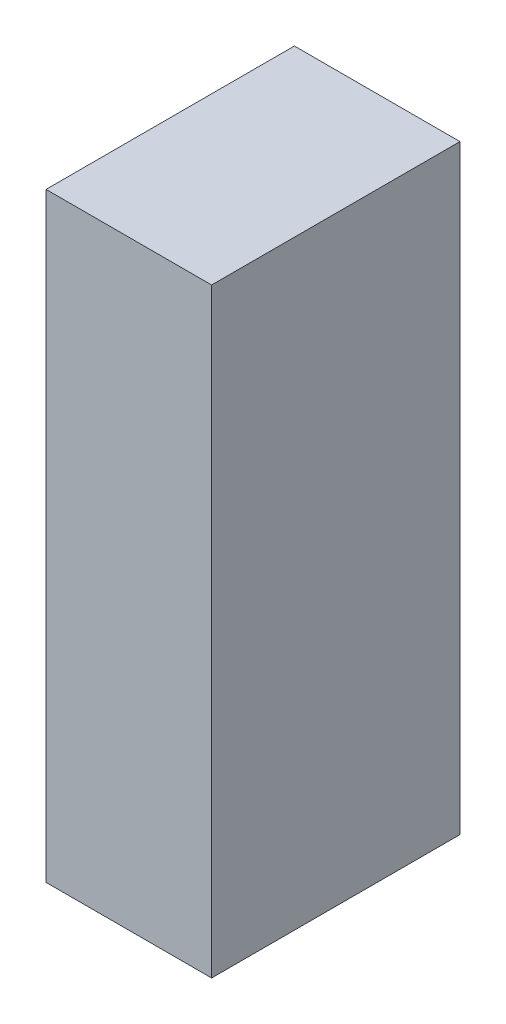
ISO-10303-21;
HEADER;
FILE_DESCRIPTION(('STEP AP214'),'2;1');
FILE_NAME('part.step','',(''),(''),'','','');
FILE_SCHEMA(('AUTOMOTIVE_DESIGN { 1 0 10303 214 1 1 1 1 }'));
ENDSEC;
DATA;
#1=APPLICATION_CONTEXT('core data for automotive mechanical design processes');
#2=APPLICATION_PROTOCOL_DEFINITION('international standard','automotive_design',2000,#1);
#3=PRODUCT_CONTEXT('',#1,'mechanical');
#4=PRODUCT('Part','Part','',(#3));
#5=PRODUCT_RELATED_PRODUCT_CATEGORY('part','',(#4));
#6=PRODUCT_DEFINITION_FORMATION('','',#4);
#7=PRODUCT_DEFINITION_CONTEXT('part definition',#1,'design');
#8=PRODUCT_DEFINITION('design','',#6,#7);
#9=PRODUCT_DEFINITION_SHAPE('','',#8);
#10=(LENGTH_UNIT() NAMED_UNIT(*) SI_UNIT(.MILLI.,.METRE.));
#11=(NAMED_UNIT(*) PLANE_ANGLE_UNIT() SI_UNIT($,.RADIAN.));
#12=(NAMED_UNIT(*) SI_UNIT($,.STERADIAN.) SOLID_ANGLE_UNIT());
#13=UNCERTAINTY_MEASURE_WITH_UNIT(LENGTH_MEASURE(1.E-05),#10,'distance_accuracy_value','');
#14=(GEOMETRIC_REPRESENTATION_CONTEXT(3) GLOBAL_UNCERTAINTY_ASSIGNED_CONTEXT((#13)) GLOBAL_UNIT_ASSIGNED_CONTEXT((#10,
#11,#12)) REPRESENTATION_CONTEXT('',''));
#15=CARTESIAN_POINT('',(0.,0.,0.));
#16=DIRECTION('',(0.,0.,1.));
#17=DIRECTION('',(1.,0.,0.));
#18=AXIS2_PLACEMENT_3D('',#15,#16,#17);
#19=CARTESIAN_POINT('',(0.700003400279698,0.725001582665158,0.));
#20=DIRECTION('',(-1.,4.37113882867379E-08,0.));
#21=DIRECTION('',(-4.37113882867379E-08,-1.,0.));
#22=AXIS2_PLACEMENT_3D('',#19,#20,#21);
#23=PLANE('',#22);
#24=DIRECTION('',(-4.37113882660258E-08,-0.999999999999999,0.));
#25=VECTOR('',#24,1.);
#26=CARTESIAN_POINT('',(0.700003400279698,0.725001582665158,0.));
#27=LINE('',#26,#25);
#28=CARTESIAN_POINT('',(0.700003400279698,0.725001582665158,0.));
#29=VERTEX_POINT('',#28);
#30=CARTESIAN_POINT('',(0.70000333689832,-0.72499536557703,0.));
#31=VERTEX_POINT('',#30);
#32=EDGE_CURVE('E11',#29,#31,#27,.T.);
#33=ORIENTED_EDGE('',*,*,#32,.T.);
#34=DIRECTION('',(0.,0.,1.));
#35=VECTOR('',#34,1.);
#36=CARTESIAN_POINT('',(0.700003336898318,-0.72499536557703,0.));
#37=LINE('',#36,#35);
#38=CARTESIAN_POINT('',(0.70000333689832,-0.72499536557703,0.599998772144318));
#39=VERTEX_POINT('',#38);
#40=EDGE_CURVE('E88',#31,#39,#37,.T.);
#41=ORIENTED_EDGE('',*,*,#40,.T.);
#42=DIRECTION('',(-4.37113882660258E-08,-0.999999999999999,0.));
#43=VECTOR('',#42,1.);
#44=CARTESIAN_POINT('',(0.700003400279698,0.725001582665158,0.599998772144318));
#45=LINE('',#44,#43);
#46=CARTESIAN_POINT('',(0.700003400279698,0.725001582665158,0.599998772144318));
#47=VERTEX_POINT('',#46);
#48=EDGE_CURVE('E83',#47,#39,#45,.T.);
#49=ORIENTED_EDGE('',*,*,#48,.F.);
#50=DIRECTION('',(0.,0.,1.));
#51=VECTOR('',#50,1.);
#52=CARTESIAN_POINT('',(0.700003400279698,0.72500158266515,0.));
#53=LINE('',#52,#51);
#54=EDGE_CURVE('E72',#29,#47,#53,.T.);
#55=ORIENTED_EDGE('',*,*,#54,.F.);
#56=EDGE_LOOP('',(#33,#41,#49,#55));
#57=FACE_BOUND('',#56,.T.);
#58=ADVANCED_FACE('F17',(#57),#23,.T.);
#59=CARTESIAN_POINT('',(0.70000333689832,-0.72499536557703,0.));
#60=DIRECTION('',(-4.37113882867379E-08,-1.,0.));
#61=DIRECTION('',(1.,-4.37113882867379E-08,0.));
#62=AXIS2_PLACEMENT_3D('',#59,#60,#61);
#63=PLANE('',#62);
#64=DIRECTION('',(0.999999999999999,-4.37113884141336E-08,0.));
#65=VECTOR('',#64,1.);
#66=CARTESIAN_POINT('',(0.70000333689832,-0.72499536557703,0.));
#67=LINE('',#66,#65);
#68=CARTESIAN_POINT('',(1.09999723338269,-0.724995383061326,0.));
#69=VERTEX_POINT('',#68);
#70=EDGE_CURVE('E24',#31,#69,#67,.T.);
#71=ORIENTED_EDGE('',*,*,#70,.T.);
#72=DIRECTION('',(0.,0.,1.));
#73=VECTOR('',#72,1.);
#74=CARTESIAN_POINT('',(1.09999723338269,-0.724995383061318,0.));
#75=LINE('',#74,#73);
#76=CARTESIAN_POINT('',(1.09999723338269,-0.724995383061326,0.599998772144318));
#77=VERTEX_POINT('',#76);
#78=EDGE_CURVE('E85',#69,#77,#75,.T.);
#79=ORIENTED_EDGE('',*,*,#78,.T.);
#80=DIRECTION('',(0.999999999999999,-4.37113884141336E-08,0.));
#81=VECTOR('',#80,1.);
#82=CARTESIAN_POINT('',(0.70000333689832,-0.72499536557703,0.599998772144318));
#83=LINE('',#82,#81);
#84=EDGE_CURVE('E66',#39,#77,#83,.T.);
#85=ORIENTED_EDGE('',*,*,#84,.F.);
#86=ORIENTED_EDGE('',*,*,#40,.F.);
#87=EDGE_LOOP('',(#71,#79,#85,#86));
#88=FACE_BOUND('',#87,.T.);
#89=ADVANCED_FACE('F89',(#88),#63,.T.);
#90=CARTESIAN_POINT('',(1.09999723338269,-0.724995383061326,0.));
#91=DIRECTION('',(1.,-4.37113882867379E-08,0.));
#92=DIRECTION('',(4.37113882867379E-08,1.,0.));
#93=AXIS2_PLACEMENT_3D('',#90,#91,#92);
#94=PLANE('',#93);
#95=DIRECTION('',(4.37113883425931E-08,0.999999999999999,0.));
#96=VECTOR('',#95,1.);
#97=CARTESIAN_POINT('',(1.09999723338269,-0.724995383061326,0.));
#98=LINE('',#97,#96);
#99=CARTESIAN_POINT('',(1.09999729676407,0.725001565180861,0.));
#100=VERTEX_POINT('',#99);
#101=EDGE_CURVE('E62',#69,#100,#98,.T.);
#102=ORIENTED_EDGE('',*,*,#101,.T.);
#103=DIRECTION('',(0.,0.,1.));
#104=VECTOR('',#103,1.);
#105=CARTESIAN_POINT('',(1.09999729676407,0.725001565180861,0.));
#106=LINE('',#105,#104);
#107=CARTESIAN_POINT('',(1.09999729676407,0.725001565180861,0.599998772144318));
#108=VERTEX_POINT('',#107);
#109=EDGE_CURVE('E55',#100,#108,#106,.T.);
#110=ORIENTED_EDGE('',*,*,#109,.T.);
#111=DIRECTION('',(4.37113883425931E-08,0.999999999999999,0.));
#112=VECTOR('',#111,1.);
#113=CARTESIAN_POINT('',(1.09999723338269,-0.724995383061326,0.599998772144318));
#114=LINE('',#113,#112);
#115=EDGE_CURVE('E59',#77,#108,#114,.T.);
#116=ORIENTED_EDGE('',*,*,#115,.F.);
#117=ORIENTED_EDGE('',*,*,#78,.F.);
#118=EDGE_LOOP('',(#102,#110,#116,#117));
#119=FACE_BOUND('',#118,.T.);
#120=ADVANCED_FACE('F57',(#119),#94,.T.);
#121=CARTESIAN_POINT('',(1.09999729676407,0.725001565180861,0.));
#122=DIRECTION('',(4.37113882867379E-08,1.,0.));
#123=DIRECTION('',(-1.,4.37113882867379E-08,0.));
#124=AXIS2_PLACEMENT_3D('',#121,#122,#123);
#125=PLANE('',#124);
#126=DIRECTION('',(-0.999999999999999,4.37113884141336E-08,0.));
#127=VECTOR('',#126,1.);
#128=CARTESIAN_POINT('',(1.09999729676407,0.725001565180861,0.));
#129=LINE('',#128,#127);
#130=EDGE_CURVE('E65',#100,#29,#129,.T.);
#131=ORIENTED_EDGE('',*,*,#130,.T.);
#132=ORIENTED_EDGE('',*,*,#54,.T.);
#133=DIRECTION('',(-0.999999999999999,4.37113884141336E-08,0.));
#134=VECTOR('',#133,1.);
#135=CARTESIAN_POINT('',(1.09999729676407,0.725001565180861,0.599998772144318));
#136=LINE('',#135,#134);
#137=EDGE_CURVE('E70',#108,#47,#136,.T.);
#138=ORIENTED_EDGE('',*,*,#137,.F.);
#139=ORIENTED_EDGE('',*,*,#109,.F.);
#140=EDGE_LOOP('',(#131,#132,#138,#139));
#141=FACE_BOUND('',#140,.T.);
#142=ADVANCED_FACE('F71',(#141),#125,.T.);
#143=CARTESIAN_POINT('',(-102.724990844727,202.199996948242,0.599998772144318));
#144=DIRECTION('',(0.,0.,1.));
#145=DIRECTION('',(-4.37113882867379E-08,-1.,0.));
#146=AXIS2_PLACEMENT_3D('',#143,#144,#145);
#147=PLANE('',#146);
#148=ORIENTED_EDGE('',*,*,#48,.T.);
#149=ORIENTED_EDGE('',*,*,#84,.T.);
#150=ORIENTED_EDGE('',*,*,#115,.T.);
#151=ORIENTED_EDGE('',*,*,#137,.T.);
#152=EDGE_LOOP('',(#148,#149,#150,#151));
#153=FACE_BOUND('',#152,.T.);
#154=ADVANCED_FACE('F76',(#153),#147,.T.);
#155=CARTESIAN_POINT('',(-102.724990844727,202.199996948242,0.));
#156=DIRECTION('',(0.,0.,1.));
#157=DIRECTION('',(-4.37113882867379E-08,-1.,0.));
#158=AXIS2_PLACEMENT_3D('',#155,#156,#157);
#159=PLANE('',#158);
#160=ORIENTED_EDGE('',*,*,#130,.F.);
#161=ORIENTED_EDGE('',*,*,#101,.F.);
#162=ORIENTED_EDGE('',*,*,#70,.F.);
#163=ORIENTED_EDGE('',*,*,#32,.F.);
#164=EDGE_LOOP('',(#160,#161,#162,#163));
#165=FACE_BOUND('',#164,.T.);
#166=ADVANCED_FACE('F91',(#165),#159,.F.);
#167=CLOSED_SHELL('',(#58,#89,#120,#142,#154,#166));
#168=MANIFOLD_SOLID_BREP('B1',#167);
#169=ADVANCED_BREP_SHAPE_REPRESENTATION('',(#18,#168),#14);
#170=SHAPE_DEFINITION_REPRESENTATION(#9,#169);
ENDSEC;
END-ISO-10303-21;
